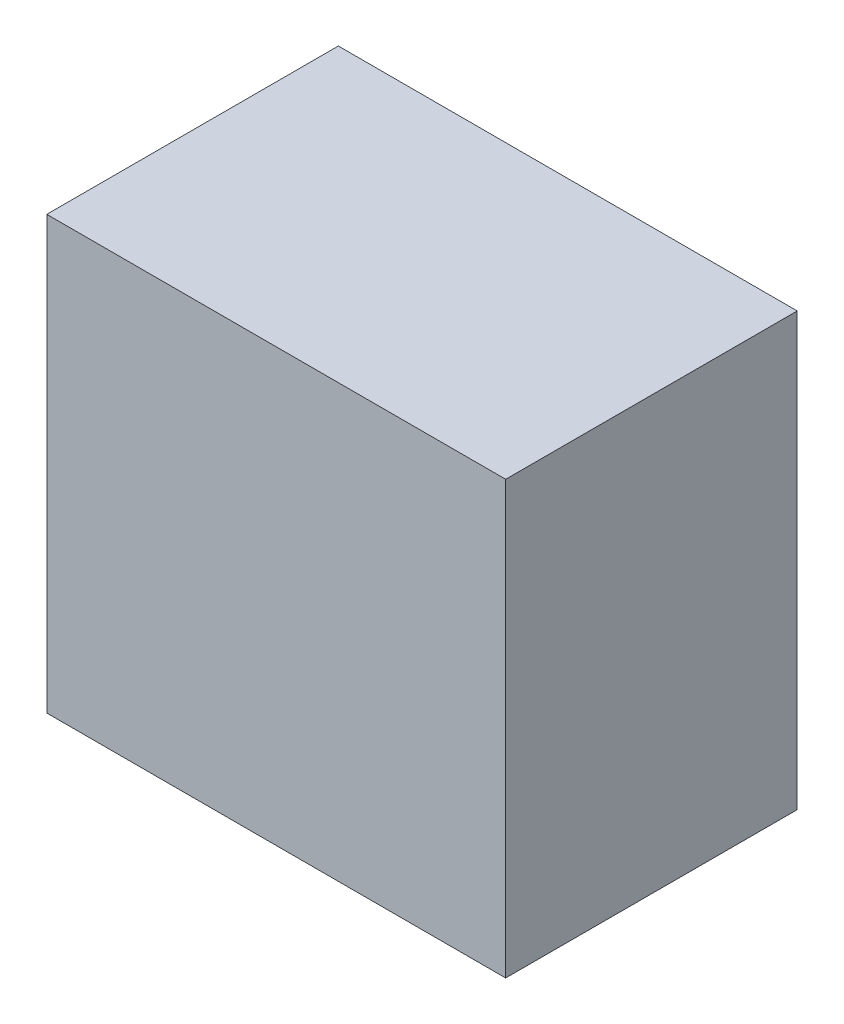
ISO-10303-21;
HEADER;
FILE_DESCRIPTION(('STEP AP214'),'2;1');
FILE_NAME('part.step','',(''),(''),'','','');
FILE_SCHEMA(('AUTOMOTIVE_DESIGN { 1 0 10303 214 1 1 1 1 }'));
ENDSEC;
DATA;
#1=APPLICATION_CONTEXT('core data for automotive mechanical design processes');
#2=APPLICATION_PROTOCOL_DEFINITION('international standard','automotive_design',2000,#1);
#3=PRODUCT_CONTEXT('',#1,'mechanical');
#4=PRODUCT('Part','Part','',(#3));
#5=PRODUCT_RELATED_PRODUCT_CATEGORY('part','',(#4));
#6=PRODUCT_DEFINITION_FORMATION('','',#4);
#7=PRODUCT_DEFINITION_CONTEXT('part definition',#1,'design');
#8=PRODUCT_DEFINITION('design','',#6,#7);
#9=PRODUCT_DEFINITION_SHAPE('','',#8);
#10=(LENGTH_UNIT() NAMED_UNIT(*) SI_UNIT(.MILLI.,.METRE.));
#11=(NAMED_UNIT(*) PLANE_ANGLE_UNIT() SI_UNIT($,.RADIAN.));
#12=(NAMED_UNIT(*) SI_UNIT($,.STERADIAN.) SOLID_ANGLE_UNIT());
#13=UNCERTAINTY_MEASURE_WITH_UNIT(LENGTH_MEASURE(1.E-05),#10,'distance_accuracy_value','');
#14=(GEOMETRIC_REPRESENTATION_CONTEXT(3) GLOBAL_UNCERTAINTY_ASSIGNED_CONTEXT((#13)) GLOBAL_UNIT_ASSIGNED_CONTEXT((#10,
#11,#12)) REPRESENTATION_CONTEXT('',''));
#15=CARTESIAN_POINT('',(0.,0.,0.));
#16=DIRECTION('',(0.,0.,1.));
#17=DIRECTION('',(1.,0.,0.));
#18=AXIS2_PLACEMENT_3D('',#15,#16,#17);
#19=CARTESIAN_POINT('',(2.71,1.35000000055774,1.55));
#20=DIRECTION('',(0.,0.,1.));
#21=DIRECTION('',(0.707106781186548,0.707106781186548,0.));
#22=AXIS2_PLACEMENT_3D('',#19,#20,#21);
#23=PLANE('',#22);
#24=DIRECTION('',(0.,1.,0.));
#25=VECTOR('',#24,1.);
#26=CARTESIAN_POINT('',(2.71,1.35000000055774,1.55));
#27=LINE('',#26,#25);
#28=CARTESIAN_POINT('',(2.71,1.35000000055774,1.55));
#29=VERTEX_POINT('',#28);
#30=CARTESIAN_POINT('',(2.71,2.14999999999938,1.55));
#31=VERTEX_POINT('',#30);
#32=EDGE_CURVE('E11',#29,#31,#27,.T.);
#33=ORIENTED_EDGE('',*,*,#32,.T.);
#34=DIRECTION('',(-1.,0.,0.));
#35=VECTOR('',#34,1.);
#36=CARTESIAN_POINT('',(2.71,2.14999999999938,1.55));
#37=LINE('',#36,#35);
#38=CARTESIAN_POINT('',(1.86,2.14999999999938,1.55));
#39=VERTEX_POINT('',#38);
#40=EDGE_CURVE('E26',#31,#39,#37,.T.);
#41=ORIENTED_EDGE('',*,*,#40,.T.);
#42=DIRECTION('',(0.,1.,0.));
#43=VECTOR('',#42,1.);
#44=CARTESIAN_POINT('',(1.86,1.35000000055774,1.55));
#45=LINE('',#44,#43);
#46=CARTESIAN_POINT('',(1.86,1.35000000055774,1.55));
#47=VERTEX_POINT('',#46);
#48=EDGE_CURVE('E78',#47,#39,#45,.T.);
#49=ORIENTED_EDGE('',*,*,#48,.F.);
#50=DIRECTION('',(-1.,0.,0.));
#51=VECTOR('',#50,1.);
#52=CARTESIAN_POINT('',(2.71,1.35000000055774,1.55));
#53=LINE('',#52,#51);
#54=EDGE_CURVE('E75',#29,#47,#53,.T.);
#55=ORIENTED_EDGE('',*,*,#54,.F.);
#56=EDGE_LOOP('',(#33,#41,#49,#55));
#57=FACE_BOUND('',#56,.T.);
#58=ADVANCED_FACE('F16',(#57),#23,.T.);
#59=CARTESIAN_POINT('',(2.71,2.14999999999938,1.55));
#60=DIRECTION('',(0.,1.,0.));
#61=DIRECTION('',(0.707106781186548,0.,0.707106781186548));
#62=AXIS2_PLACEMENT_3D('',#59,#60,#61);
#63=PLANE('',#62);
#64=DIRECTION('',(0.,0.,-1.));
#65=VECTOR('',#64,1.);
#66=CARTESIAN_POINT('',(2.71,2.14999999999938,1.55));
#67=LINE('',#66,#65);
#68=CARTESIAN_POINT('',(2.71,2.14999999999938,1.01));
#69=VERTEX_POINT('',#68);
#70=EDGE_CURVE('E83',#31,#69,#67,.T.);
#71=ORIENTED_EDGE('',*,*,#70,.T.);
#72=DIRECTION('',(-1.,0.,0.));
#73=VECTOR('',#72,1.);
#74=CARTESIAN_POINT('',(2.71,2.14999999999938,1.01));
#75=LINE('',#74,#73);
#76=CARTESIAN_POINT('',(1.86,2.14999999999938,1.01));
#77=VERTEX_POINT('',#76);
#78=EDGE_CURVE('E85',#69,#77,#75,.T.);
#79=ORIENTED_EDGE('',*,*,#78,.T.);
#80=DIRECTION('',(0.,0.,-1.));
#81=VECTOR('',#80,1.);
#82=CARTESIAN_POINT('',(1.86,2.14999999999938,1.55));
#83=LINE('',#82,#81);
#84=EDGE_CURVE('E62',#39,#77,#83,.T.);
#85=ORIENTED_EDGE('',*,*,#84,.F.);
#86=ORIENTED_EDGE('',*,*,#40,.F.);
#87=EDGE_LOOP('',(#71,#79,#85,#86));
#88=FACE_BOUND('',#87,.T.);
#89=ADVANCED_FACE('F88',(#88),#63,.T.);
#90=CARTESIAN_POINT('',(2.71,2.14999999999938,1.01));
#91=DIRECTION('',(0.,0.,-1.));
#92=DIRECTION('',(0.707106781186548,0.707106781186548,0.));
#93=AXIS2_PLACEMENT_3D('',#90,#91,#92);
#94=PLANE('',#93);
#95=DIRECTION('',(0.,-1.,0.));
#96=VECTOR('',#95,1.);
#97=CARTESIAN_POINT('',(2.71,2.14999999999938,1.01));
#98=LINE('',#97,#96);
#99=CARTESIAN_POINT('',(2.71,1.35000000055774,1.01));
#100=VERTEX_POINT('',#99);
#101=EDGE_CURVE('E68',#69,#100,#98,.T.);
#102=ORIENTED_EDGE('',*,*,#101,.T.);
#103=DIRECTION('',(-1.,0.,0.));
#104=VECTOR('',#103,1.);
#105=CARTESIAN_POINT('',(2.71,1.35000000055774,1.01));
#106=LINE('',#105,#104);
#107=CARTESIAN_POINT('',(1.86,1.35000000055774,1.01));
#108=VERTEX_POINT('',#107);
#109=EDGE_CURVE('E54',#100,#108,#106,.T.);
#110=ORIENTED_EDGE('',*,*,#109,.T.);
#111=DIRECTION('',(0.,-1.,0.));
#112=VECTOR('',#111,1.);
#113=CARTESIAN_POINT('',(1.86,2.14999999999938,1.01));
#114=LINE('',#113,#112);
#115=EDGE_CURVE('E60',#77,#108,#114,.T.);
#116=ORIENTED_EDGE('',*,*,#115,.F.);
#117=ORIENTED_EDGE('',*,*,#78,.F.);
#118=EDGE_LOOP('',(#102,#110,#116,#117));
#119=FACE_BOUND('',#118,.T.);
#120=ADVANCED_FACE('F66',(#119),#94,.T.);
#121=CARTESIAN_POINT('',(2.71,1.35000000055774,1.01));
#122=DIRECTION('',(0.,-1.,0.));
#123=DIRECTION('',(0.707106781186548,0.,0.707106781186548));
#124=AXIS2_PLACEMENT_3D('',#121,#122,#123);
#125=PLANE('',#124);
#126=DIRECTION('',(0.,0.,1.));
#127=VECTOR('',#126,1.);
#128=CARTESIAN_POINT('',(2.71,1.35000000055774,1.01));
#129=LINE('',#128,#127);
#130=EDGE_CURVE('E70',#100,#29,#129,.T.);
#131=ORIENTED_EDGE('',*,*,#130,.T.);
#132=ORIENTED_EDGE('',*,*,#54,.T.);
#133=DIRECTION('',(0.,0.,1.));
#134=VECTOR('',#133,1.);
#135=CARTESIAN_POINT('',(1.86,1.35000000055774,1.01));
#136=LINE('',#135,#134);
#137=EDGE_CURVE('E20',#108,#47,#136,.T.);
#138=ORIENTED_EDGE('',*,*,#137,.F.);
#139=ORIENTED_EDGE('',*,*,#109,.F.);
#140=EDGE_LOOP('',(#131,#132,#138,#139));
#141=FACE_BOUND('',#140,.T.);
#142=ADVANCED_FACE('F73',(#141),#125,.T.);
#143=CARTESIAN_POINT('',(1.86,0.,0.));
#144=DIRECTION('',(-1.,0.,0.));
#145=DIRECTION('',(0.,0.707106781186548,0.707106781186548));
#146=AXIS2_PLACEMENT_3D('',#143,#144,#145);
#147=PLANE('',#146);
#148=ORIENTED_EDGE('',*,*,#48,.T.);
#149=ORIENTED_EDGE('',*,*,#84,.T.);
#150=ORIENTED_EDGE('',*,*,#115,.T.);
#151=ORIENTED_EDGE('',*,*,#137,.T.);
#152=EDGE_LOOP('',(#148,#149,#150,#151));
#153=FACE_BOUND('',#152,.T.);
#154=ADVANCED_FACE('F61',(#153),#147,.T.);
#155=CARTESIAN_POINT('',(2.71,0.,0.));
#156=DIRECTION('',(-1.,0.,0.));
#157=DIRECTION('',(0.,0.707106781186548,0.707106781186548));
#158=AXIS2_PLACEMENT_3D('',#155,#156,#157);
#159=PLANE('',#158);
#160=ORIENTED_EDGE('',*,*,#130,.F.);
#161=ORIENTED_EDGE('',*,*,#101,.F.);
#162=ORIENTED_EDGE('',*,*,#70,.F.);
#163=ORIENTED_EDGE('',*,*,#32,.F.);
#164=EDGE_LOOP('',(#160,#161,#162,#163));
#165=FACE_BOUND('',#164,.T.);
#166=ADVANCED_FACE('F18',(#165),#159,.F.);
#167=CLOSED_SHELL('',(#58,#89,#120,#142,#154,#166));
#168=MANIFOLD_SOLID_BREP('B1',#167);
#169=ADVANCED_BREP_SHAPE_REPRESENTATION('',(#18,#168),#14);
#170=SHAPE_DEFINITION_REPRESENTATION(#9,#169);
ENDSEC;
END-ISO-10303-21;
